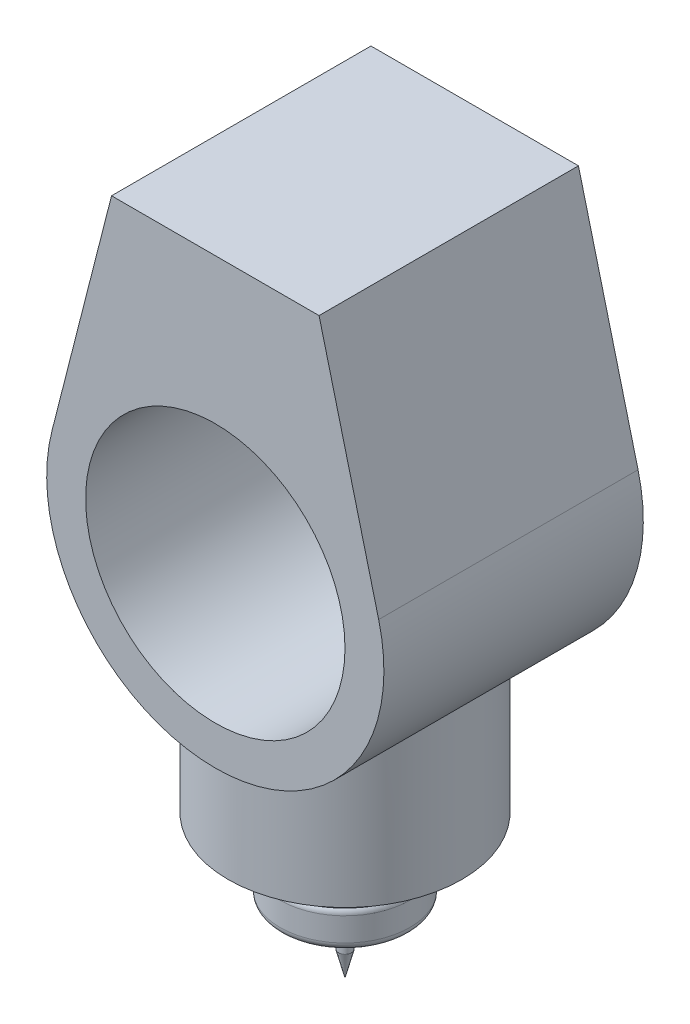
ISO-10303-21;
HEADER;
FILE_DESCRIPTION(('STEP AP214'),'2;1');
FILE_NAME('part.step','',(''),(''),'','','');
FILE_SCHEMA(('AUTOMOTIVE_DESIGN { 1 0 10303 214 1 1 1 1 }'));
ENDSEC;
DATA;
#1=APPLICATION_CONTEXT('core data for automotive mechanical design processes');
#2=APPLICATION_PROTOCOL_DEFINITION('international standard','automotive_design',2000,#1);
#3=PRODUCT_CONTEXT('',#1,'mechanical');
#4=PRODUCT('Part','Part','',(#3));
#5=PRODUCT_RELATED_PRODUCT_CATEGORY('part','',(#4));
#6=PRODUCT_DEFINITION_FORMATION('','',#4);
#7=PRODUCT_DEFINITION_CONTEXT('part definition',#1,'design');
#8=PRODUCT_DEFINITION('design','',#6,#7);
#9=PRODUCT_DEFINITION_SHAPE('','',#8);
#10=(LENGTH_UNIT() NAMED_UNIT(*) SI_UNIT(.MILLI.,.METRE.));
#11=(NAMED_UNIT(*) PLANE_ANGLE_UNIT() SI_UNIT($,.RADIAN.));
#12=(NAMED_UNIT(*) SI_UNIT($,.STERADIAN.) SOLID_ANGLE_UNIT());
#13=UNCERTAINTY_MEASURE_WITH_UNIT(LENGTH_MEASURE(1.E-05),#10,'distance_accuracy_value','');
#14=(GEOMETRIC_REPRESENTATION_CONTEXT(3) GLOBAL_UNCERTAINTY_ASSIGNED_CONTEXT((#13)) GLOBAL_UNIT_ASSIGNED_CONTEXT((#10,
#11,#12)) REPRESENTATION_CONTEXT('',''));
#15=CARTESIAN_POINT('',(0.,0.,0.));
#16=DIRECTION('',(0.,0.,1.));
#17=DIRECTION('',(1.,0.,0.));
#18=AXIS2_PLACEMENT_3D('',#15,#16,#17);
#19=CARTESIAN_POINT('',(0.,-45.7119917553549,0.));
#20=DIRECTION('',(0.,-1.,0.));
#21=DIRECTION('',(0.,0.,-1.));
#22=AXIS2_PLACEMENT_3D('',#19,#20,#21);
#23=CYLINDRICAL_SURFACE('',#22,20.);
#24=CARTESIAN_POINT('',(0.,5.26054272377328,0.));
#25=DIRECTION('',(0.,-1.,0.));
#26=DIRECTION('',(0.,0.,-1.));
#27=AXIS2_PLACEMENT_3D('',#24,#25,#26);
#28=CIRCLE('',#27,20.);
#29=CARTESIAN_POINT('',(0.,5.26054272377328,-20.));
#30=VERTEX_POINT('',#29);
#31=EDGE_CURVE('E205',#30,#30,#28,.T.);
#32=ORIENTED_EDGE('',*,*,#31,.T.);
#33=EDGE_LOOP('',(#32));
#34=FACE_BOUND('',#33,.T.);
#35=CARTESIAN_POINT('',(0.,4.26054272377328,0.));
#36=DIRECTION('',(0.,-1.,0.));
#37=DIRECTION('',(0.,0.,-1.));
#38=AXIS2_PLACEMENT_3D('',#35,#36,#37);
#39=CIRCLE('',#38,20.);
#40=CARTESIAN_POINT('',(0.,4.26054272377328,-20.));
#41=VERTEX_POINT('',#40);
#42=EDGE_CURVE('E199',#41,#41,#39,.F.);
#43=ORIENTED_EDGE('',*,*,#42,.T.);
#44=EDGE_LOOP('',(#43));
#45=FACE_BOUND('',#44,.T.);
#46=ADVANCED_FACE('F36',(#34,#45),#23,.T.);
#47=CARTESIAN_POINT('',(0.,-45.7119917553549,0.));
#48=DIRECTION('',(0.,-1.,0.));
#49=DIRECTION('',(0.,0.,-1.));
#50=AXIS2_PLACEMENT_3D('',#47,#48,#49);
#51=CYLINDRICAL_SURFACE('',#50,25.);
#52=CARTESIAN_POINT('',(0.,-10.7394572762267,0.));
#53=DIRECTION('',(0.,1.,0.));
#54=DIRECTION('',(0.,0.,1.));
#55=AXIS2_PLACEMENT_3D('',#52,#53,#54);
#56=CIRCLE('',#55,25.);
#57=CARTESIAN_POINT('',(0.,-10.7394572762267,25.));
#58=VERTEX_POINT('',#57);
#59=EDGE_CURVE('E193',#58,#58,#56,.T.);
#60=ORIENTED_EDGE('',*,*,#59,.T.);
#61=EDGE_LOOP('',(#60));
#62=FACE_BOUND('',#61,.T.);
#63=CARTESIAN_POINT('',(0.,-1.65553705932634,0.));
#64=DIRECTION('',(0.,1.,0.));
#65=DIRECTION('',(0.,0.,1.));
#66=AXIS2_PLACEMENT_3D('',#63,#64,#65);
#67=CIRCLE('',#66,25.);
#68=CARTESIAN_POINT('',(0.,-1.65553705932634,25.));
#69=VERTEX_POINT('',#68);
#70=EDGE_CURVE('E191',#69,#69,#67,.F.);
#71=ORIENTED_EDGE('',*,*,#70,.T.);
#72=EDGE_LOOP('',(#71));
#73=FACE_BOUND('',#72,.T.);
#74=ADVANCED_FACE('F153',(#62,#73),#51,.T.);
#75=CARTESIAN_POINT('',(-25.,-13.7394572762267,0.));
#76=DIRECTION('',(0.,1.,0.));
#77=DIRECTION('',(0.,0.,1.));
#78=AXIS2_PLACEMENT_3D('',#75,#76,#77);
#79=PLANE('',#78);
#80=CARTESIAN_POINT('',(0.,-13.7394572762267,0.));
#81=DIRECTION('',(0.,1.,0.));
#82=DIRECTION('',(0.,0.,1.));
#83=AXIS2_PLACEMENT_3D('',#80,#81,#82);
#84=CIRCLE('',#83,22.);
#85=CARTESIAN_POINT('',(0.,-13.7394572762267,22.));
#86=VERTEX_POINT('',#85);
#87=EDGE_CURVE('E194',#86,#86,#84,.F.);
#88=ORIENTED_EDGE('',*,*,#87,.T.);
#89=EDGE_LOOP('',(#88));
#90=FACE_BOUND('',#89,.T.);
#91=CARTESIAN_POINT('',(0.,-13.7394572762267,0.));
#92=DIRECTION('',(0.,-1.,0.));
#93=DIRECTION('',(0.,0.,-1.));
#94=AXIS2_PLACEMENT_3D('',#91,#92,#93);
#95=CIRCLE('',#94,10.);
#96=CARTESIAN_POINT('',(0.,-13.7394572762267,-10.));
#97=VERTEX_POINT('',#96);
#98=EDGE_CURVE('E365',#97,#97,#95,.T.);
#99=ORIENTED_EDGE('',*,*,#98,.F.);
#100=EDGE_LOOP('',(#99));
#101=FACE_BOUND('',#100,.T.);
#102=ADVANCED_FACE('F159',(#90,#101),#79,.F.);
#103=CARTESIAN_POINT('',(0.,-13.7394572762267,0.));
#104=DIRECTION('',(0.,1.,0.));
#105=DIRECTION('',(0.,0.,1.));
#106=AXIS2_PLACEMENT_3D('',#103,#104,#105);
#107=CONICAL_SURFACE('',#106,10.,0.523598775598297);
#108=CARTESIAN_POINT('',(0.,-22.3997113140711,0.));
#109=DIRECTION('',(0.,-1.,0.));
#110=DIRECTION('',(0.,0.,-1.));
#111=AXIS2_PLACEMENT_3D('',#108,#109,#110);
#112=CIRCLE('',#111,5.00000000000002);
#113=CARTESIAN_POINT('',(0.,-22.3997113140711,-5.00000000000002));
#114=VERTEX_POINT('',#113);
#115=EDGE_CURVE('E362',#114,#114,#112,.T.);
#116=ORIENTED_EDGE('',*,*,#115,.F.);
#117=EDGE_LOOP('',(#116));
#118=FACE_BOUND('',#117,.T.);
#119=ORIENTED_EDGE('',*,*,#98,.T.);
#120=EDGE_LOOP('',(#119));
#121=FACE_BOUND('',#120,.T.);
#122=ADVANCED_FACE('F301',(#118,#121),#107,.T.);
#123=CARTESIAN_POINT('',(-5.00000000000002,-22.3997113140711,0.));
#124=DIRECTION('',(0.,1.,0.));
#125=DIRECTION('',(0.,0.,1.));
#126=AXIS2_PLACEMENT_3D('',#123,#124,#125);
#127=PLANE('',#126);
#128=CARTESIAN_POINT('',(0.,-22.3997113140711,0.));
#129=DIRECTION('',(0.,-1.,0.));
#130=DIRECTION('',(0.,0.,-1.));
#131=AXIS2_PLACEMENT_3D('',#128,#129,#130);
#132=CIRCLE('',#131,2.50000000000002);
#133=CARTESIAN_POINT('',(0.,-22.3997113140711,-2.50000000000002));
#134=VERTEX_POINT('',#133);
#135=EDGE_CURVE('E369',#134,#134,#132,.T.);
#136=ORIENTED_EDGE('',*,*,#135,.F.);
#137=EDGE_LOOP('',(#136));
#138=FACE_BOUND('',#137,.T.);
#139=ORIENTED_EDGE('',*,*,#115,.T.);
#140=EDGE_LOOP('',(#139));
#141=FACE_BOUND('',#140,.T.);
#142=ADVANCED_FACE('F329',(#138,#141),#127,.F.);
#143=CARTESIAN_POINT('',(0.,-45.7119917553549,0.));
#144=DIRECTION('',(0.,-1.,0.));
#145=DIRECTION('',(0.,0.,-1.));
#146=AXIS2_PLACEMENT_3D('',#143,#144,#145);
#147=CYLINDRICAL_SURFACE('',#146,2.50000000000002);
#148=CARTESIAN_POINT('',(0.,-30.3997113140711,0.));
#149=DIRECTION('',(0.,-1.,0.));
#150=DIRECTION('',(0.,0.,-1.));
#151=AXIS2_PLACEMENT_3D('',#148,#149,#150);
#152=CIRCLE('',#151,2.50000000000002);
#153=CARTESIAN_POINT('',(0.,-30.3997113140711,-2.50000000000002));
#154=VERTEX_POINT('',#153);
#155=EDGE_CURVE('E124',#154,#154,#152,.T.);
#156=ORIENTED_EDGE('',*,*,#155,.F.);
#157=EDGE_LOOP('',(#156));
#158=FACE_BOUND('',#157,.T.);
#159=ORIENTED_EDGE('',*,*,#135,.T.);
#160=EDGE_LOOP('',(#159));
#161=FACE_BOUND('',#160,.T.);
#162=ADVANCED_FACE('F320',(#158,#161),#147,.T.);
#163=CARTESIAN_POINT('',(0.,-30.3997113140711,0.));
#164=DIRECTION('',(0.,1.,0.));
#165=DIRECTION('',(0.,0.,1.));
#166=AXIS2_PLACEMENT_3D('',#163,#164,#165);
#167=CONICAL_SURFACE('',#166,2.50000000000002,0.25268025514208);
#168=CARTESIAN_POINT('',(0.,-40.0821696795896,0.));
#169=VERTEX_POINT('',#168);
#170=VERTEX_LOOP('',#169);
#171=FACE_BOUND('',#170,.T.);
#172=ORIENTED_EDGE('',*,*,#155,.T.);
#173=EDGE_LOOP('',(#172));
#174=FACE_BOUND('',#173,.T.);
#175=ADVANCED_FACE('F170',(#171,#174),#167,.T.);
#176=CARTESIAN_POINT('',(0.,4.26054272377328,0.));
#177=DIRECTION('',(0.,-1.,0.));
#178=DIRECTION('',(0.,0.,-1.));
#179=AXIS2_PLACEMENT_3D('',#176,#177,#178);
#180=TOROIDAL_SURFACE('',#179,23.,3.);
#181=CARTESIAN_POINT('',(0.,1.30250283222513,0.));
#182=DIRECTION('',(0.,1.,0.));
#183=DIRECTION('',(0.,0.,1.));
#184=AXIS2_PLACEMENT_3D('',#181,#182,#183);
#185=CIRCLE('',#184,22.5000000000003);
#186=CARTESIAN_POINT('',(0.,1.30250283222513,22.5000000000003));
#187=VERTEX_POINT('',#186);
#188=EDGE_CURVE('E188',#187,#187,#185,.T.);
#189=ORIENTED_EDGE('',*,*,#188,.T.);
#190=EDGE_LOOP('',(#189));
#191=FACE_BOUND('',#190,.T.);
#192=ORIENTED_EDGE('',*,*,#42,.F.);
#193=EDGE_LOOP('',(#192));
#194=FACE_BOUND('',#193,.T.);
#195=ADVANCED_FACE('F166',(#191,#194),#180,.F.);
#196=CARTESIAN_POINT('',(0.,-10.7394572762267,0.));
#197=DIRECTION('',(0.,1.,0.));
#198=DIRECTION('',(0.,0.,1.));
#199=AXIS2_PLACEMENT_3D('',#196,#197,#198);
#200=TOROIDAL_SURFACE('',#199,22.,3.);
#201=ORIENTED_EDGE('',*,*,#59,.F.);
#202=EDGE_LOOP('',(#201));
#203=FACE_BOUND('',#202,.T.);
#204=ORIENTED_EDGE('',*,*,#87,.F.);
#205=EDGE_LOOP('',(#204));
#206=FACE_BOUND('',#205,.T.);
#207=ADVANCED_FACE('F169',(#203,#206),#200,.T.);
#208=CARTESIAN_POINT('',(0.,-1.65553705932634,0.));
#209=DIRECTION('',(0.,1.,0.));
#210=DIRECTION('',(0.,0.,1.));
#211=AXIS2_PLACEMENT_3D('',#208,#209,#210);
#212=TOROIDAL_SURFACE('',#211,22.,3.);
#213=ORIENTED_EDGE('',*,*,#188,.F.);
#214=EDGE_LOOP('',(#213));
#215=FACE_BOUND('',#214,.T.);
#216=ORIENTED_EDGE('',*,*,#70,.F.);
#217=EDGE_LOOP('',(#216));
#218=FACE_BOUND('',#217,.T.);
#219=ADVANCED_FACE('F174',(#215,#218),#212,.T.);
#220=CARTESIAN_POINT('',(0.,5.26054272377328,0.));
#221=DIRECTION('',(0.,1.,0.));
#222=DIRECTION('',(0.,0.,1.));
#223=AXIS2_PLACEMENT_3D('',#220,#221,#222);
#224=CYLINDRICAL_SURFACE('',#223,32.5);
#225=CARTESIAN_POINT('',(0.,7.26054272377328,0.));
#226=DIRECTION('',(0.,-1.,0.));
#227=DIRECTION('',(0.,0.,-1.));
#228=AXIS2_PLACEMENT_3D('',#225,#226,#227);
#229=CIRCLE('',#228,32.5);
#230=CARTESIAN_POINT('',(0.,7.26054272377328,-32.5));
#231=VERTEX_POINT('',#230);
#232=EDGE_CURVE('E11',#231,#231,#229,.F.);
#233=ORIENTED_EDGE('',*,*,#232,.T.);
#234=EDGE_LOOP('',(#233));
#235=FACE_BOUND('',#234,.T.);
#236=CARTESIAN_POINT('',(0.,13.2605427237733,0.));
#237=DIRECTION('',(0.,1.,0.));
#238=DIRECTION('',(0.,0.,1.));
#239=AXIS2_PLACEMENT_3D('',#236,#237,#238);
#240=CIRCLE('',#239,32.5);
#241=CARTESIAN_POINT('',(0.,13.2605427237733,32.5));
#242=VERTEX_POINT('',#241);
#243=EDGE_CURVE('E204',#242,#242,#240,.F.);
#244=ORIENTED_EDGE('',*,*,#243,.T.);
#245=EDGE_LOOP('',(#244));
#246=FACE_BOUND('',#245,.T.);
#247=ADVANCED_FACE('F177',(#235,#246),#224,.T.);
#248=CARTESIAN_POINT('',(0.,5.26054272377328,0.));
#249=DIRECTION('',(0.,-1.,0.));
#250=DIRECTION('',(0.,0.,-1.));
#251=AXIS2_PLACEMENT_3D('',#248,#249,#250);
#252=PLANE('',#251);
#253=CARTESIAN_POINT('',(0.,5.26054272377328,0.));
#254=DIRECTION('',(0.,-1.,0.));
#255=DIRECTION('',(0.,0.,-1.));
#256=AXIS2_PLACEMENT_3D('',#253,#254,#255);
#257=CIRCLE('',#256,30.5);
#258=CARTESIAN_POINT('',(0.,5.26054272377328,-30.5));
#259=VERTEX_POINT('',#258);
#260=EDGE_CURVE('E44',#259,#259,#257,.T.);
#261=ORIENTED_EDGE('',*,*,#260,.T.);
#262=EDGE_LOOP('',(#261));
#263=FACE_BOUND('',#262,.T.);
#264=ORIENTED_EDGE('',*,*,#31,.F.);
#265=EDGE_LOOP('',(#264));
#266=FACE_BOUND('',#265,.T.);
#267=ADVANCED_FACE('F182',(#263,#266),#252,.T.);
#268=CARTESIAN_POINT('',(0.,120.,50.));
#269=DIRECTION('',(0.,0.,-1.));
#270=DIRECTION('',(-1.,0.,0.));
#271=AXIS2_PLACEMENT_3D('',#268,#269,#270);
#272=CYLINDRICAL_SURFACE('',#271,50.);
#273=CARTESIAN_POINT('',(0.,120.,50.));
#274=DIRECTION('',(0.,0.,1.));
#275=DIRECTION('',(1.,0.,0.));
#276=AXIS2_PLACEMENT_3D('',#273,#274,#275);
#277=CIRCLE('',#276,50.);
#278=CARTESIAN_POINT('',(50.,120.,50.));
#279=VERTEX_POINT('',#278);
#280=EDGE_CURVE('E112',#279,#279,#277,.T.);
#281=ORIENTED_EDGE('',*,*,#280,.T.);
#282=EDGE_LOOP('',(#281));
#283=FACE_BOUND('',#282,.T.);
#284=CARTESIAN_POINT('',(0.,120.,-50.));
#285=DIRECTION('',(0.,0.,1.));
#286=DIRECTION('',(1.,0.,0.));
#287=AXIS2_PLACEMENT_3D('',#284,#285,#286);
#288=CIRCLE('',#287,50.);
#289=CARTESIAN_POINT('',(50.,120.,-50.));
#290=VERTEX_POINT('',#289);
#291=EDGE_CURVE('E207',#290,#290,#288,.T.);
#292=ORIENTED_EDGE('',*,*,#291,.F.);
#293=EDGE_LOOP('',(#292));
#294=FACE_BOUND('',#293,.T.);
#295=ADVANCED_FACE('F242',(#283,#294),#272,.F.);
#296=CARTESIAN_POINT('',(40.,226.080432898653,50.));
#297=DIRECTION('',(0.,-1.,0.));
#298=DIRECTION('',(0.,0.,-1.));
#299=AXIS2_PLACEMENT_3D('',#296,#297,#298);
#300=PLANE('',#299);
#301=DIRECTION('',(-1.,0.,0.));
#302=VECTOR('',#301,1.);
#303=CARTESIAN_POINT('',(40.,226.080432898653,-50.));
#304=LINE('',#303,#302);
#305=CARTESIAN_POINT('',(40.,226.080432898653,-50.));
#306=VERTEX_POINT('',#305);
#307=CARTESIAN_POINT('',(-40.,226.080432898653,-50.));
#308=VERTEX_POINT('',#307);
#309=EDGE_CURVE('E75',#306,#308,#304,.T.);
#310=ORIENTED_EDGE('',*,*,#309,.T.);
#311=DIRECTION('',(0.,0.,-1.));
#312=VECTOR('',#311,1.);
#313=CARTESIAN_POINT('',(-40.,226.080432898653,50.));
#314=LINE('',#313,#312);
#315=CARTESIAN_POINT('',(-40.,226.080432898653,50.));
#316=VERTEX_POINT('',#315);
#317=EDGE_CURVE('E105',#316,#308,#314,.T.);
#318=ORIENTED_EDGE('',*,*,#317,.F.);
#319=DIRECTION('',(-1.,0.,0.));
#320=VECTOR('',#319,1.);
#321=CARTESIAN_POINT('',(40.,226.080432898653,50.));
#322=LINE('',#321,#320);
#323=CARTESIAN_POINT('',(40.,226.080432898653,50.));
#324=VERTEX_POINT('',#323);
#325=EDGE_CURVE('E55',#324,#316,#322,.T.);
#326=ORIENTED_EDGE('',*,*,#325,.F.);
#327=DIRECTION('',(0.,0.,-1.));
#328=VECTOR('',#327,1.);
#329=CARTESIAN_POINT('',(40.,226.080432898653,50.));
#330=LINE('',#329,#328);
#331=EDGE_CURVE('E101',#324,#306,#330,.T.);
#332=ORIENTED_EDGE('',*,*,#331,.T.);
#333=EDGE_LOOP('',(#310,#318,#326,#332));
#334=FACE_BOUND('',#333,.T.);
#335=ADVANCED_FACE('F246',(#334),#300,.F.);
#336=CARTESIAN_POINT('',(-40.,226.080432898653,50.));
#337=DIRECTION('',(0.968915660351213,-0.247391275363892,0.));
#338=DIRECTION('',(0.247391275363892,0.968915660351213,0.));
#339=AXIS2_PLACEMENT_3D('',#336,#337,#338);
#340=PLANE('',#339);
#341=DIRECTION('',(-0.247391275363892,-0.968915660351213,0.));
#342=VECTOR('',#341,1.);
#343=CARTESIAN_POINT('',(-40.,226.080432898653,-50.));
#344=LINE('',#343,#342);
#345=CARTESIAN_POINT('',(-62.9795179228289,136.080432898653,-50.));
#346=VERTEX_POINT('',#345);
#347=EDGE_CURVE('E109',#308,#346,#344,.T.);
#348=ORIENTED_EDGE('',*,*,#347,.T.);
#349=DIRECTION('',(0.,0.,-1.));
#350=VECTOR('',#349,1.);
#351=CARTESIAN_POINT('',(-62.9795179228289,136.080432898653,50.));
#352=LINE('',#351,#350);
#353=CARTESIAN_POINT('',(-62.9795179228289,136.080432898653,50.));
#354=VERTEX_POINT('',#353);
#355=EDGE_CURVE('E100',#354,#346,#352,.T.);
#356=ORIENTED_EDGE('',*,*,#355,.F.);
#357=DIRECTION('',(-0.247391275363892,-0.968915660351213,0.));
#358=VECTOR('',#357,1.);
#359=CARTESIAN_POINT('',(-40.,226.080432898653,50.));
#360=LINE('',#359,#358);
#361=EDGE_CURVE('E90',#316,#354,#360,.T.);
#362=ORIENTED_EDGE('',*,*,#361,.F.);
#363=ORIENTED_EDGE('',*,*,#317,.T.);
#364=EDGE_LOOP('',(#348,#356,#362,#363));
#365=FACE_BOUND('',#364,.T.);
#366=ADVANCED_FACE('F138',(#365),#340,.F.);
#367=CARTESIAN_POINT('',(0.,120.,50.));
#368=DIRECTION('',(0.,0.,1.));
#369=DIRECTION('',(1.,0.,0.));
#370=AXIS2_PLACEMENT_3D('',#367,#368,#369);
#371=PLANE('',#370);
#372=ORIENTED_EDGE('',*,*,#361,.T.);
#373=CARTESIAN_POINT('',(0.,120.,50.));
#374=DIRECTION('',(0.,0.,1.));
#375=DIRECTION('',(1.,0.,0.));
#376=AXIS2_PLACEMENT_3D('',#373,#374,#375);
#377=CIRCLE('',#376,65.);
#378=CARTESIAN_POINT('',(62.9795179228289,136.080432898653,50.));
#379=VERTEX_POINT('',#378);
#380=EDGE_CURVE('E83',#354,#379,#377,.T.);
#381=ORIENTED_EDGE('',*,*,#380,.T.);
#382=DIRECTION('',(-0.247391275363892,0.968915660351213,0.));
#383=VECTOR('',#382,1.);
#384=CARTESIAN_POINT('',(40.,226.080432898653,50.));
#385=LINE('',#384,#383);
#386=EDGE_CURVE('E87',#379,#324,#385,.T.);
#387=ORIENTED_EDGE('',*,*,#386,.T.);
#388=ORIENTED_EDGE('',*,*,#325,.T.);
#389=EDGE_LOOP('',(#372,#381,#387,#388));
#390=FACE_BOUND('',#389,.T.);
#391=ORIENTED_EDGE('',*,*,#280,.F.);
#392=EDGE_LOOP('',(#391));
#393=FACE_BOUND('',#392,.T.);
#394=ADVANCED_FACE('F84',(#390,#393),#371,.T.);
#395=CARTESIAN_POINT('',(40.,226.080432898653,50.));
#396=DIRECTION('',(-0.968915660351213,-0.247391275363892,0.));
#397=DIRECTION('',(0.247391275363892,-0.968915660351213,0.));
#398=AXIS2_PLACEMENT_3D('',#395,#396,#397);
#399=PLANE('',#398);
#400=DIRECTION('',(-0.247391275363892,0.968915660351213,0.));
#401=VECTOR('',#400,1.);
#402=CARTESIAN_POINT('',(40.,226.080432898653,-50.));
#403=LINE('',#402,#401);
#404=CARTESIAN_POINT('',(62.9795179228289,136.080432898653,-50.));
#405=VERTEX_POINT('',#404);
#406=EDGE_CURVE('E114',#405,#306,#403,.T.);
#407=ORIENTED_EDGE('',*,*,#406,.T.);
#408=ORIENTED_EDGE('',*,*,#331,.F.);
#409=ORIENTED_EDGE('',*,*,#386,.F.);
#410=DIRECTION('',(0.,0.,-1.));
#411=VECTOR('',#410,1.);
#412=CARTESIAN_POINT('',(62.9795179228289,136.080432898653,50.));
#413=LINE('',#412,#411);
#414=EDGE_CURVE('E94',#379,#405,#413,.T.);
#415=ORIENTED_EDGE('',*,*,#414,.T.);
#416=EDGE_LOOP('',(#407,#408,#409,#415));
#417=FACE_BOUND('',#416,.T.);
#418=ADVANCED_FACE('F103',(#417),#399,.F.);
#419=CARTESIAN_POINT('',(0.,120.,-50.));
#420=DIRECTION('',(0.,0.,1.));
#421=DIRECTION('',(1.,0.,0.));
#422=AXIS2_PLACEMENT_3D('',#419,#420,#421);
#423=PLANE('',#422);
#424=ORIENTED_EDGE('',*,*,#347,.F.);
#425=ORIENTED_EDGE('',*,*,#309,.F.);
#426=ORIENTED_EDGE('',*,*,#406,.F.);
#427=CARTESIAN_POINT('',(0.,120.,-50.));
#428=DIRECTION('',(0.,0.,1.));
#429=DIRECTION('',(1.,0.,0.));
#430=AXIS2_PLACEMENT_3D('',#427,#428,#429);
#431=CIRCLE('',#430,65.);
#432=EDGE_CURVE('E97',#346,#405,#431,.T.);
#433=ORIENTED_EDGE('',*,*,#432,.F.);
#434=EDGE_LOOP('',(#424,#425,#426,#433));
#435=FACE_BOUND('',#434,.T.);
#436=ORIENTED_EDGE('',*,*,#291,.T.);
#437=EDGE_LOOP('',(#436));
#438=FACE_BOUND('',#437,.T.);
#439=ADVANCED_FACE('F250',(#435,#438),#423,.F.);
#440=CARTESIAN_POINT('',(0.,120.,50.));
#441=DIRECTION('',(0.,0.,-1.));
#442=DIRECTION('',(-1.,0.,0.));
#443=AXIS2_PLACEMENT_3D('',#440,#441,#442);
#444=CYLINDRICAL_SURFACE('',#443,65.);
#445=ORIENTED_EDGE('',*,*,#432,.T.);
#446=ORIENTED_EDGE('',*,*,#414,.F.);
#447=ORIENTED_EDGE('',*,*,#380,.F.);
#448=ORIENTED_EDGE('',*,*,#355,.T.);
#449=EDGE_LOOP('',(#445,#446,#447,#448));
#450=FACE_BOUND('',#449,.T.);
#451=CARTESIAN_POINT('',(0.,55.0000000000045,-45.));
#452=CARTESIAN_POINT('',(-1.12147330120578,54.9999988303988,-45.0000012025283));
#453=CARTESIAN_POINT('',(-2.24292945230804,55.02908402348,-44.9580201602482));
#454=CARTESIAN_POINT('',(-4.4765841407912,55.1446931358605,-44.7907856093689));
#455=CARTESIAN_POINT('',(-5.58878288911968,55.2312157426909,-44.6655340035371));
#456=CARTESIAN_POINT('',(-7.79555151848658,55.4596214237002,-44.3336771879691));
#457=CARTESIAN_POINT('',(-8.89011506447775,55.6015239496546,-44.1270433931238));
#458=CARTESIAN_POINT('',(-11.0533096019769,55.9373542563034,-43.6354760134034));
#459=CARTESIAN_POINT('',(-12.1219400915897,56.1312830430136,-43.3505409144375));
#460=CARTESIAN_POINT('',(-14.2212125160507,56.5657777255338,-42.7078017297045));
#461=CARTESIAN_POINT('',(-15.2520162370064,56.8061081454356,-42.3503651251477));
#462=CARTESIAN_POINT('',(-17.2756280115287,57.3290740553076,-41.5659763086892));
#463=CARTESIAN_POINT('',(-18.268436318107,57.6117092635086,-41.1390245597888));
#464=CARTESIAN_POINT('',(-20.2116697228796,58.213891446068,-40.2199419970837));
#465=CARTESIAN_POINT('',(-21.1620951960856,58.5334380937369,-39.7278117601443));
#466=CARTESIAN_POINT('',(-23.0172309124316,59.2037828415936,-38.6825647509799));
#467=CARTESIAN_POINT('',(-23.9219389167187,59.5545824699667,-38.1294449962194));
#468=CARTESIAN_POINT('',(-25.760188014023,60.3134351025527,-36.9151737617933));
#469=CARTESIAN_POINT('',(-26.6893215363406,60.7238118459801,-36.2488040005489));
#470=CARTESIAN_POINT('',(-28.4880338622969,61.5669724942752,-34.8529502059223));
#471=CARTESIAN_POINT('',(-29.3576098626541,61.999757452182,-34.1234632053606));
#472=CARTESIAN_POINT('',(-31.0364486388515,62.8804888163524,-32.6040251352401));
#473=CARTESIAN_POINT('',(-31.8456267033453,63.328455281811,-31.8139921794121));
#474=CARTESIAN_POINT('',(-33.4006700551816,64.2308013938863,-30.1773036556991));
#475=CARTESIAN_POINT('',(-34.1465316534291,64.6851814123882,-29.3306447936719));
#476=CARTESIAN_POINT('',(-35.6959084068905,65.6696885654406,-27.4326466159465));
#477=CARTESIAN_POINT('',(-36.4872853280243,66.1994062488732,-26.3711450656524));
#478=CARTESIAN_POINT('',(-37.9773509509912,67.2406672108068,-24.1760402563897));
#479=CARTESIAN_POINT('',(-38.6760162868263,67.7522058839774,-23.0424189272515));
#480=CARTESIAN_POINT('',(-39.9749077721745,68.7391850734958,-20.7072341856926));
#481=CARTESIAN_POINT('',(-40.5752630453965,69.2146724924728,-19.5057627267964));
#482=CARTESIAN_POINT('',(-41.6721166930026,70.1107600836208,-17.0369318640638));
#483=CARTESIAN_POINT('',(-42.1686687478854,70.5313885828343,-15.769606940994));
#484=CARTESIAN_POINT('',(-42.9149535309565,71.1791970583122,-13.5723996352813));
#485=CARTESIAN_POINT('',(-43.1936925213246,71.4261579736443,-12.6581208440973));
#486=CARTESIAN_POINT('',(-43.6944569649789,71.8761198255877,-10.8035389223548));
#487=CARTESIAN_POINT('',(-43.9164916250902,72.0791278978071,-9.86324004407391));
#488=CARTESIAN_POINT('',(-44.3005296261305,72.4339245073453,-7.96250438663381));
#489=CARTESIAN_POINT('',(-44.4626304606428,72.5857961912956,-7.00210302149459));
#490=CARTESIAN_POINT('',(-44.7246555122386,72.8328736154823,-5.0655405262849));
#491=CARTESIAN_POINT('',(-44.824579749433,72.9280793740471,-4.08937940131198));
#492=CARTESIAN_POINT('',(-44.9607388198673,73.0581100909057,-2.12323648479645));
#493=CARTESIAN_POINT('',(-44.9966266570423,73.0926060654583,-1.13320851844634));
#494=CARTESIAN_POINT('',(-45.0029190462422,73.0986428864524,0.847248377094085));
#495=CARTESIAN_POINT('',(-44.9733237202183,73.0701838501369,1.83767730553423));
#496=CARTESIAN_POINT('',(-44.8492190899201,72.9515697150179,3.81128752429104));
#497=CARTESIAN_POINT('',(-44.754670149242,72.8613769447899,4.79446401850684));
#498=CARTESIAN_POINT('',(-44.5024241630868,72.623168682392,6.74551496467478));
#499=CARTESIAN_POINT('',(-44.3447257499009,72.4751519378562,7.71338908473189));
#500=CARTESIAN_POINT('',(-43.9803320764262,72.1378235728159,9.56919366964704));
#501=CARTESIAN_POINT('',(-43.7772163066585,71.9515850911135,10.4583970625521));
#502=CARTESIAN_POINT('',(-43.3201064011899,71.5390558953593,12.2144143492183));
#503=CARTESIAN_POINT('',(-43.0660934784814,71.3127503954885,13.0812198417585));
#504=CARTESIAN_POINT('',(-42.5096331932464,70.8261490359616,14.7898225666929));
#505=CARTESIAN_POINT('',(-42.2071601049958,70.5658351361165,15.6316062329483));
#506=CARTESIAN_POINT('',(-41.5563350032134,70.0174817203665,17.2876417419015));
#507=CARTESIAN_POINT('',(-41.2079902580443,69.7294465988303,18.1018979206951));
#508=CARTESIAN_POINT('',(-40.2767822129267,68.9774568528655,20.1137766396804));
#509=CARTESIAN_POINT('',(-39.6654891440571,68.4992565476671,21.2930273345179));
#510=CARTESIAN_POINT('',(-38.3480299208519,67.5108841218522,23.5833678403923));
#511=CARTESIAN_POINT('',(-37.6418264436725,67.0006994659411,24.6944305853526));
#512=CARTESIAN_POINT('',(-36.1376496350165,65.9638442026505,26.8476775780097));
#513=CARTESIAN_POINT('',(-35.3395185623558,65.4371464214538,27.8897384505713));
#514=CARTESIAN_POINT('',(-33.6558443419669,64.3828195532821,29.8998791095634));
#515=CARTESIAN_POINT('',(-32.7703120184232,63.8551905895581,30.86796803075));
#516=CARTESIAN_POINT('',(-30.9045304086317,62.8067550298864,32.736392147566));
#517=CARTESIAN_POINT('',(-29.923373129519,62.2860808649017,33.6358963165069));
#518=CARTESIAN_POINT('',(-27.8771206485977,61.2703580463534,35.3503553497922));
#519=CARTESIAN_POINT('',(-26.8120178135977,60.7753117299338,36.165302509702));
#520=CARTESIAN_POINT('',(-24.6035209522418,59.824343304436,37.7024332048815));
#521=CARTESIAN_POINT('',(-23.4602711709791,59.3683524348404,38.4247809320634));
#522=CARTESIAN_POINT('',(-21.0989507187332,58.5068108391788,39.770332376577));
#523=CARTESIAN_POINT('',(-19.8809026570886,58.1012449821269,40.3935658507716));
#524=CARTESIAN_POINT('',(-17.654903587576,57.4353197052216,41.4059204565396));
#525=CARTESIAN_POINT('',(-16.6602403417731,57.1627017451532,41.816312053501));
#526=CARTESIAN_POINT('',(-14.6345031625141,56.6602835922671,42.5675669112336));
#527=CARTESIAN_POINT('',(-13.6034342999587,56.4304774640019,42.9084398107235));
#528=CARTESIAN_POINT('',(-11.5110112910013,56.0184950097403,43.5164676119119));
#529=CARTESIAN_POINT('',(-10.4496726714619,55.8362947349256,43.7836595836379));
#530=CARTESIAN_POINT('',(-8.30296993183346,55.5233601342049,44.2409869387356));
#531=CARTESIAN_POINT('',(-7.21760530180228,55.3926269017743,44.431120684921));
#532=CARTESIAN_POINT('',(-5.02649787174997,55.1852654263317,44.7321113931983));
#533=CARTESIAN_POINT('',(-3.92069290489737,55.1088465038306,44.8426616714378));
#534=CARTESIAN_POINT('',(-1.70145350776182,55.0127816642315,44.981563734156));
#535=CARTESIAN_POINT('',(-0.588019080747438,54.9931357228126,45.0099155538474));
#536=CARTESIAN_POINT('',(1.6374178193159,55.0110998758055,44.9839662509349));
#537=CARTESIAN_POINT('',(2.7494202874799,55.0487101650249,44.929664847113));
#538=CARTESIAN_POINT('',(4.96298947367625,55.1802655819471,44.7392747901951));
#539=CARTESIAN_POINT('',(6.06455651648149,55.2742089505535,44.6031886909653));
#540=CARTESIAN_POINT('',(8.18254449212171,55.508824296691,44.2620157992033));
#541=CARTESIAN_POINT('',(9.20007959997796,55.6463191319822,44.0616107864453));
#542=CARTESIAN_POINT('',(11.2121337136591,55.9662143939093,43.5930613516679));
#543=CARTESIAN_POINT('',(12.2066538475802,56.1486126144501,43.3249202574928));
#544=CARTESIAN_POINT('',(14.1673074608525,56.5548274750926,42.7239854011604));
#545=CARTESIAN_POINT('',(15.1334386601225,56.7786474315369,42.3911864622047));
#546=CARTESIAN_POINT('',(17.0327019487275,57.263663647323,41.6643868113868));
#547=CARTESIAN_POINT('',(17.9658321902032,57.5248619955152,41.2703826790342));
#548=CARTESIAN_POINT('',(19.8637431772397,58.1009914914879,40.3931275129007));
#549=CARTESIAN_POINT('',(20.8256806929255,58.41847904715,39.9054081529013));
#550=CARTESIAN_POINT('',(22.7035764997347,59.0857913608606,38.867707618121));
#551=CARTESIAN_POINT('',(23.619532978653,59.4356173918918,38.3177239921567));
#552=CARTESIAN_POINT('',(25.4032558353405,60.16186528706,37.1592008079417));
#553=CARTESIAN_POINT('',(26.2709963143292,60.538301202456,36.5506302507531));
#554=CARTESIAN_POINT('',(27.9557544991498,61.3115422329665,35.2787474176623));
#555=CARTESIAN_POINT('',(28.772769468114,61.708348445043,34.6154321925308));
#556=CARTESIAN_POINT('',(30.4889708749913,62.5848288146208,33.119920084716));
#557=CARTESIAN_POINT('',(31.378521200693,63.0671245447454,32.2781812569546));
#558=CARTESIAN_POINT('',(33.0839042215171,64.0409106890907,30.5278352445588));
#559=CARTESIAN_POINT('',(33.8997259516809,64.5324024578752,29.6192181500898));
#560=CARTESIAN_POINT('',(35.4558699474101,65.5139649612604,27.737571493399));
#561=CARTESIAN_POINT('',(36.1961418986445,66.0040345403884,26.7644997080005));
#562=CARTESIAN_POINT('',(37.5978502361013,66.9705165002566,24.7568233036379));
#563=CARTESIAN_POINT('',(38.2592969946586,67.4469306715851,23.7222268074146));
#564=CARTESIAN_POINT('',(39.429101356464,68.3200586522741,21.7149007388744));
#565=CARTESIAN_POINT('',(39.9463152685164,68.7196627515185,20.7485884228092));
#566=CARTESIAN_POINT('',(40.9130636661731,69.4876025451089,18.7705314851883));
#567=CARTESIAN_POINT('',(41.3625976757849,69.8559380195348,17.7587865441702));
#568=CARTESIAN_POINT('',(42.189330129269,70.5495071077636,15.6937972650627));
#569=CARTESIAN_POINT('',(42.5666442029471,70.8748093587528,14.6406225749499));
#570=CARTESIAN_POINT('',(43.2451098617227,71.4709901978989,12.4950157035287));
#571=CARTESIAN_POINT('',(43.5462799449171,71.7418820010048,11.4025931307275));
#572=CARTESIAN_POINT('',(44.0186874861181,72.1728389587625,9.39216299943492));
#573=CARTESIAN_POINT('',(44.2036946073208,72.3441580094782,8.47979353570401));
#574=CARTESIAN_POINT('',(44.517583244497,72.6372393046969,6.63757582668227));
#575=CARTESIAN_POINT('',(44.6464717105955,72.7590076857776,5.70772976070355));
#576=CARTESIAN_POINT('',(44.8459556683364,72.94833384295,3.83718735816953));
#577=CARTESIAN_POINT('',(44.9166073394188,73.0159438623491,2.89650236820496));
#578=CARTESIAN_POINT('',(44.9985645522097,73.0944301734318,1.01014116515017));
#579=CARTESIAN_POINT('',(45.0098692606967,73.105305668572,0.0644648821696078));
#580=CARTESIAN_POINT('',(44.972908524549,73.0698591222881,-1.82506201386822));
#581=CARTESIAN_POINT('',(44.9246160680299,73.0235111448304,-2.76891160474219));
#582=CARTESIAN_POINT('',(44.7693052695385,72.8754767696967,-4.6473189128988));
#583=CARTESIAN_POINT('',(44.6622872796082,72.773790703756,-5.58187668584892));
#584=CARTESIAN_POINT('',(44.3911660407895,72.5188576737371,-7.43666598606578));
#585=CARTESIAN_POINT('',(44.2269923369624,72.365547080606,-8.35687836049694));
#586=CARTESIAN_POINT('',(43.8440109221367,72.0128110964402,-10.1768310643424));
#587=CARTESIAN_POINT('',(43.6251959006592,71.8133795351311,-11.0765686368374));
#588=CARTESIAN_POINT('',(43.0625185245671,71.3091217077634,-13.1167261780631));
#589=CARTESIAN_POINT('',(42.7008255731353,70.99060276494,-14.2488681052184));
#590=CARTESIAN_POINT('',(41.8955268796885,70.300445505839,-16.4668795226375));
#591=CARTESIAN_POINT('',(41.4518955887102,69.9287906295837,-17.5527344499463));
#592=CARTESIAN_POINT('',(40.4872212981012,69.1455876280237,-19.676032998432));
#593=CARTESIAN_POINT('',(39.9660881554128,68.7339932450966,-20.7134183727639));
#594=CARTESIAN_POINT('',(38.8508952329154,67.8837881206939,-22.7363587217867));
#595=CARTESIAN_POINT('',(38.256840025456,67.4451790739464,-23.7219169406074));
#596=CARTESIAN_POINT('',(36.9847423381262,66.5420642214497,-25.6613286822635));
#597=CARTESIAN_POINT('',(36.305111863905,66.0771978898628,-26.6139712103079));
#598=CARTESIAN_POINT('',(34.8753950985047,65.1416666656053,-28.4617532840732));
#599=CARTESIAN_POINT('',(34.1253089107935,64.6710017814511,-29.3568929142369));
#600=CARTESIAN_POINT('',(32.5564691651911,63.7335660866497,-31.0876310121467));
#601=CARTESIAN_POINT('',(31.7376950080827,63.2667964906569,-31.9232114784022));
#602=CARTESIAN_POINT('',(30.0334816520248,62.3464834144564,-33.5315189390537));
#603=CARTESIAN_POINT('',(29.1480362003109,61.8929411803237,-34.3042400240123));
#604=CARTESIAN_POINT('',(27.1643113596243,60.9364715663755,-35.9022819462668));
#605=CARTESIAN_POINT('',(26.0547472869607,60.437389370908,-36.7159606163358));
#606=CARTESIAN_POINT('',(23.7521280348394,59.4823242770641,-38.2458641369293));
#607=CARTESIAN_POINT('',(22.5590599397194,59.0263480716925,-38.9620738611552));
#608=CARTESIAN_POINT('',(20.7127348127307,58.3850073420585,-39.95586233221));
#609=CARTESIAN_POINT('',(20.0881105839986,58.178408034482,-40.27358881652));
#610=CARTESIAN_POINT('',(18.8206694867553,57.7808452994142,-40.881243654886));
#611=CARTESIAN_POINT('',(18.1778552539994,57.5898796220434,-41.1711760099036));
#612=CARTESIAN_POINT('',(16.8752831176647,57.2251472766316,-41.7219931318357));
#613=CARTESIAN_POINT('',(16.2155288469418,57.0513769591447,-41.9828840638125));
#614=CARTESIAN_POINT('',(14.8804011558231,56.7224643524263,-42.4744610119284));
#615=CARTESIAN_POINT('',(14.2050288695915,56.567320715579,-42.7051492133046));
#616=CARTESIAN_POINT('',(12.4447010544913,56.1929278031899,-43.2597449448101));
#617=CARTESIAN_POINT('',(11.3490405228653,55.9885815531985,-43.5602757498286));
#618=CARTESIAN_POINT('',(9.12991345978803,55.6345808017913,-44.0788276443961));
#619=CARTESIAN_POINT('',(8.00645117856267,55.4849179950578,-44.2968612637911));
#620=CARTESIAN_POINT('',(5.74082253729136,55.2440006812936,-44.6470112993715));
#621=CARTESIAN_POINT('',(4.598670910622,55.1527022428948,-44.7791923387442));
#622=CARTESIAN_POINT('',(2.30434018473217,55.0307023703131,-44.9556862638234));
#623=CARTESIAN_POINT('',(1.152161041602,55.0000012016151,-44.999998764566));
#624=CARTESIAN_POINT('',(0.,55.0000000000045,-45.));
#625=B_SPLINE_CURVE_WITH_KNOTS('',3,(#451,#452,#453,#454,#455,#456,#457,#458,#459,#460,#461,
#462,#463,#464,#465,#466,#467,#468,#469,#470,#471,#472,#473,#474,#475,#476,#477,#478,#479,#480,
#481,#482,#483,#484,#485,#486,#487,#488,#489,#490,#491,#492,#493,#494,#495,#496,#497,#498,#499,
#500,#501,#502,#503,#504,#505,#506,#507,#508,#509,#510,#511,#512,#513,#514,#515,#516,#517,#518,
#519,#520,#521,#522,#523,#524,#525,#526,#527,#528,#529,#530,#531,#532,#533,#534,#535,#536,#537,
#538,#539,#540,#541,#542,#543,#544,#545,#546,#547,#548,#549,#550,#551,#552,#553,#554,#555,#556,
#557,#558,#559,#560,#561,#562,#563,#564,#565,#566,#567,#568,#569,#570,#571,#572,#573,#574,#575,
#576,#577,#578,#579,#580,#581,#582,#583,#584,#585,#586,#587,#588,#589,#590,#591,#592,#593,#594,
#595,#596,#597,#598,#599,#600,#601,#602,#603,#604,#605,#606,#607,#608,#609,#610,#611,#612,#613,
#614,#615,#616,#617,#618,#619,#620,#621,#622,#623,#624),.UNSPECIFIED.,.T.,.F.,(4,2,2,2,2,2,2,2,
2,2,2,2,2,2,2,2,2,2,2,2,2,2,2,2,2,2,2,2,2,2,2,2,2,2,2,2,2,2,2,2,2,2,2,2,2,2,2,2,2,2,2,2,2,2,2,2,
2,2,2,2,2,2,2,2,2,2,2,2,2,2,2,2,2,2,2,2,2,2,2,2,2,2,2,2,2,2,4),(0.,3.36323892794167,
6.72640100710163,10.0907454360666,13.4551549250109,16.8029195613731,20.1506619010728,
23.4983746134035,26.8462511096754,30.4871649037348,34.1282499524347,37.7743494260166,
41.420661191741,45.6939383064407,49.9682903731883,54.2369825353394,58.5034617073674,
61.4625138492407,64.4210852373374,67.3748225577203,70.3285589227265,73.2982527376574,
76.2679410220409,79.2394430998939,82.2110095388413,85.001141172639,87.7923045951579,
90.5849546837761,93.3771628083066,97.6064034875676,101.837312178738,106.075592113262,
110.313347816193,114.596218662803,118.879479402293,123.155037051936,127.429308626694,
130.755998382163,134.082226580387,137.406778235214,140.731400520075,144.068767009318,
147.406132068879,150.743508483461,154.080780688208,157.215791533369,160.35064838675,
163.485756334407,166.621039552605,169.990545063149,173.360183268584,176.73161428665,
180.103227050672,184.047902440152,187.993163521895,191.94103513809,195.888386692538,
199.385185586645,202.88200907258,206.373186157812,209.863514294627,212.700365177753,
215.536864625513,218.370624567028,221.204424293963,224.039508887241,226.874576485218,
229.713151272815,232.55210603787,236.23803941247,239.925124033802,243.616531168718,
247.307706963637,251.081871120678,254.856029735252,258.63132427736,262.406973327354,
266.792058434818,271.177823293659,273.368885604935,275.55963203795,277.749912517597,
279.940034437727,283.398420446896,286.856280978073,290.31153567335,293.76680550653),.UNSPECIFIED.);
#626=CARTESIAN_POINT('',(0.,55.0000000000045,-45.));
#627=VERTEX_POINT('',#626);
#628=EDGE_CURVE('E120',#627,#627,#625,.T.);
#629=ORIENTED_EDGE('',*,*,#628,.T.);
#630=EDGE_LOOP('',(#629));
#631=FACE_BOUND('',#630,.T.);
#632=ADVANCED_FACE('F95',(#450,#631),#444,.T.);
#633=CARTESIAN_POINT('',(0.,500000.,0.));
#634=DIRECTION('',(0.,-1.,0.));
#635=DIRECTION('',(0.,0.,-1.));
#636=AXIS2_PLACEMENT_3D('',#633,#634,#635);
#637=CYLINDRICAL_SURFACE('',#636,45.);
#638=CARTESIAN_POINT('',(0.,15.2605427237733,0.));
#639=DIRECTION('',(0.,1.,0.));
#640=DIRECTION('',(0.,0.,1.));
#641=AXIS2_PLACEMENT_3D('',#638,#639,#640);
#642=CIRCLE('',#641,45.);
#643=CARTESIAN_POINT('',(0.,15.2605427237733,45.));
#644=VERTEX_POINT('',#643);
#645=EDGE_CURVE('E121',#644,#644,#642,.T.);
#646=ORIENTED_EDGE('',*,*,#645,.T.);
#647=EDGE_LOOP('',(#646));
#648=FACE_BOUND('',#647,.T.);
#649=ORIENTED_EDGE('',*,*,#628,.F.);
#650=EDGE_LOOP('',(#649));
#651=FACE_BOUND('',#650,.T.);
#652=ADVANCED_FACE('F132',(#648,#651),#637,.T.);
#653=CARTESIAN_POINT('',(0.,15.2605427237733,0.));
#654=DIRECTION('',(0.,1.,0.));
#655=DIRECTION('',(0.,0.,1.));
#656=AXIS2_PLACEMENT_3D('',#653,#654,#655);
#657=PLANE('',#656);
#658=CARTESIAN_POINT('',(-34.6410161513773,15.2605427237733,20.0000000000004));
#659=DIRECTION('',(0.,-1.,0.));
#660=DIRECTION('',(0.866025403784433,0.,-0.50000000000001));
#661=AXIS2_PLACEMENT_3D('',#658,#659,#660);
#662=CIRCLE('',#661,4.);
#663=CARTESIAN_POINT('',(-31.1769145362396,15.2605427237733,18.0000000000004));
#664=VERTEX_POINT('',#663);
#665=EDGE_CURVE('E530',#664,#664,#662,.T.);
#666=ORIENTED_EDGE('',*,*,#665,.F.);
#667=EDGE_LOOP('',(#666));
#668=FACE_BOUND('',#667,.T.);
#669=CARTESIAN_POINT('',(-34.6410161513777,15.2605427237733,-19.9999999999997));
#670=DIRECTION('',(0.,-1.,0.));
#671=DIRECTION('',(0.866025403784443,0.,0.499999999999992));
#672=AXIS2_PLACEMENT_3D('',#669,#670,#671);
#673=CIRCLE('',#672,4.);
#674=CARTESIAN_POINT('',(-31.17691453624,15.2605427237733,-17.9999999999997));
#675=VERTEX_POINT('',#674);
#676=EDGE_CURVE('E529',#675,#675,#673,.T.);
#677=ORIENTED_EDGE('',*,*,#676,.F.);
#678=EDGE_LOOP('',(#677));
#679=FACE_BOUND('',#678,.T.);
#680=CARTESIAN_POINT('',(0.,15.2605427237733,-40.));
#681=DIRECTION('',(0.,-1.,0.));
#682=DIRECTION('',(0.,0.,1.));
#683=AXIS2_PLACEMENT_3D('',#680,#681,#682);
#684=CIRCLE('',#683,4.);
#685=CARTESIAN_POINT('',(0.,15.2605427237733,-36.));
#686=VERTEX_POINT('',#685);
#687=EDGE_CURVE('E578',#686,#686,#684,.T.);
#688=ORIENTED_EDGE('',*,*,#687,.F.);
#689=EDGE_LOOP('',(#688));
#690=FACE_BOUND('',#689,.T.);
#691=CARTESIAN_POINT('',(34.6410161513775,15.2605427237733,-20.0000000000002));
#692=DIRECTION('',(0.,-1.,0.));
#693=DIRECTION('',(-0.866025403784436,0.,0.500000000000004));
#694=AXIS2_PLACEMENT_3D('',#691,#692,#693);
#695=CIRCLE('',#694,4.);
#696=CARTESIAN_POINT('',(31.1769145362397,15.2605427237733,-18.0000000000001));
#697=VERTEX_POINT('',#696);
#698=EDGE_CURVE('E569',#697,#697,#695,.T.);
#699=ORIENTED_EDGE('',*,*,#698,.F.);
#700=EDGE_LOOP('',(#699));
#701=FACE_BOUND('',#700,.T.);
#702=CARTESIAN_POINT('',(34.6410161513776,15.2605427237733,19.9999999999999));
#703=DIRECTION('',(0.,-1.,0.));
#704=DIRECTION('',(-0.86602540378444,0.,-0.499999999999998));
#705=AXIS2_PLACEMENT_3D('',#702,#703,#704);
#706=CIRCLE('',#705,4.);
#707=CARTESIAN_POINT('',(31.1769145362398,15.2605427237733,17.9999999999999));
#708=VERTEX_POINT('',#707);
#709=EDGE_CURVE('E543',#708,#708,#706,.T.);
#710=ORIENTED_EDGE('',*,*,#709,.F.);
#711=EDGE_LOOP('',(#710));
#712=FACE_BOUND('',#711,.T.);
#713=CARTESIAN_POINT('',(0.,15.2605427237733,40.));
#714=DIRECTION('',(0.,-1.,0.));
#715=DIRECTION('',(0.,0.,-1.));
#716=AXIS2_PLACEMENT_3D('',#713,#714,#715);
#717=CIRCLE('',#716,4.);
#718=CARTESIAN_POINT('',(0.,15.2605427237733,36.));
#719=VERTEX_POINT('',#718);
#720=EDGE_CURVE('E542',#719,#719,#717,.T.);
#721=ORIENTED_EDGE('',*,*,#720,.F.);
#722=EDGE_LOOP('',(#721));
#723=FACE_BOUND('',#722,.T.);
#724=CARTESIAN_POINT('',(0.,15.2605427237733,0.));
#725=DIRECTION('',(0.,1.,0.));
#726=DIRECTION('',(0.,0.,1.));
#727=AXIS2_PLACEMENT_3D('',#724,#725,#726);
#728=CIRCLE('',#727,34.5);
#729=CARTESIAN_POINT('',(0.,15.2605427237733,34.5));
#730=VERTEX_POINT('',#729);
#731=EDGE_CURVE('E211',#730,#730,#728,.T.);
#732=ORIENTED_EDGE('',*,*,#731,.T.);
#733=EDGE_LOOP('',(#732));
#734=FACE_BOUND('',#733,.T.);
#735=ORIENTED_EDGE('',*,*,#645,.F.);
#736=EDGE_LOOP('',(#735));
#737=FACE_BOUND('',#736,.T.);
#738=ADVANCED_FACE('F140',(#668,#679,#690,#701,#712,#723,#734,#737),#657,.F.);
#739=CARTESIAN_POINT('',(0.,13.2605427237733,0.));
#740=DIRECTION('',(0.,1.,0.));
#741=DIRECTION('',(0.,0.,1.));
#742=AXIS2_PLACEMENT_3D('',#739,#740,#741);
#743=TOROIDAL_SURFACE('',#742,34.5,2.);
#744=ORIENTED_EDGE('',*,*,#731,.F.);
#745=EDGE_LOOP('',(#744));
#746=FACE_BOUND('',#745,.T.);
#747=ORIENTED_EDGE('',*,*,#243,.F.);
#748=EDGE_LOOP('',(#747));
#749=FACE_BOUND('',#748,.T.);
#750=ADVANCED_FACE('F142',(#746,#749),#743,.F.);
#751=CARTESIAN_POINT('',(0.,7.26054272377328,0.));
#752=DIRECTION('',(0.,-1.,0.));
#753=DIRECTION('',(0.,0.,-1.));
#754=AXIS2_PLACEMENT_3D('',#751,#752,#753);
#755=TOROIDAL_SURFACE('',#754,30.5,2.);
#756=ORIENTED_EDGE('',*,*,#232,.F.);
#757=EDGE_LOOP('',(#756));
#758=FACE_BOUND('',#757,.T.);
#759=ORIENTED_EDGE('',*,*,#260,.F.);
#760=EDGE_LOOP('',(#759));
#761=FACE_BOUND('',#760,.T.);
#762=ADVANCED_FACE('F38',(#758,#761),#755,.T.);
#763=CARTESIAN_POINT('',(0.,20.2605427237733,40.));
#764=DIRECTION('',(0.,-1.,0.));
#765=DIRECTION('',(0.,0.,-1.));
#766=AXIS2_PLACEMENT_3D('',#763,#764,#765);
#767=CYLINDRICAL_SURFACE('',#766,4.);
#768=CARTESIAN_POINT('',(0.,20.2605427237733,40.));
#769=DIRECTION('',(0.,-1.,0.));
#770=DIRECTION('',(0.,0.,-1.));
#771=AXIS2_PLACEMENT_3D('',#768,#769,#770);
#772=CIRCLE('',#771,4.);
#773=CARTESIAN_POINT('',(0.,20.2605427237733,36.));
#774=VERTEX_POINT('',#773);
#775=EDGE_CURVE('E208',#774,#774,#772,.T.);
#776=ORIENTED_EDGE('',*,*,#775,.F.);
#777=EDGE_LOOP('',(#776));
#778=FACE_BOUND('',#777,.T.);
#779=ORIENTED_EDGE('',*,*,#720,.T.);
#780=EDGE_LOOP('',(#779));
#781=FACE_BOUND('',#780,.T.);
#782=ADVANCED_FACE('F219',(#778,#781),#767,.F.);
#783=CARTESIAN_POINT('',(0.,20.2605427237733,40.));
#784=DIRECTION('',(0.,-1.,0.));
#785=DIRECTION('',(0.,0.,-1.));
#786=AXIS2_PLACEMENT_3D('',#783,#784,#785);
#787=PLANE('',#786);
#788=ORIENTED_EDGE('',*,*,#775,.T.);
#789=EDGE_LOOP('',(#788));
#790=FACE_BOUND('',#789,.T.);
#791=ADVANCED_FACE('F224',(#790),#787,.T.);
#792=CARTESIAN_POINT('',(34.6410161513776,20.2605427237733,19.9999999999999));
#793=DIRECTION('',(0.,-1.,0.));
#794=DIRECTION('',(0.,0.,-1.));
#795=AXIS2_PLACEMENT_3D('',#792,#793,#794);
#796=CYLINDRICAL_SURFACE('',#795,4.);
#797=CARTESIAN_POINT('',(34.6410161513776,20.2605427237733,19.9999999999999));
#798=DIRECTION('',(0.,-1.,0.));
#799=DIRECTION('',(-0.86602540378444,0.,-0.499999999999998));
#800=AXIS2_PLACEMENT_3D('',#797,#798,#799);
#801=CIRCLE('',#800,4.);
#802=CARTESIAN_POINT('',(31.1769145362398,20.2605427237733,17.9999999999999));
#803=VERTEX_POINT('',#802);
#804=EDGE_CURVE('E539',#803,#803,#801,.T.);
#805=ORIENTED_EDGE('',*,*,#804,.F.);
#806=EDGE_LOOP('',(#805));
#807=FACE_BOUND('',#806,.T.);
#808=ORIENTED_EDGE('',*,*,#709,.T.);
#809=EDGE_LOOP('',(#808));
#810=FACE_BOUND('',#809,.T.);
#811=ADVANCED_FACE('F234',(#807,#810),#796,.F.);
#812=CARTESIAN_POINT('',(34.6410161513776,20.2605427237733,19.9999999999999));
#813=DIRECTION('',(0.,-1.,0.));
#814=DIRECTION('',(-0.86602540378444,0.,-0.499999999999998));
#815=AXIS2_PLACEMENT_3D('',#812,#813,#814);
#816=PLANE('',#815);
#817=ORIENTED_EDGE('',*,*,#804,.T.);
#818=EDGE_LOOP('',(#817));
#819=FACE_BOUND('',#818,.T.);
#820=ADVANCED_FACE('F433',(#819),#816,.T.);
#821=CARTESIAN_POINT('',(34.6410161513775,20.2605427237733,-20.0000000000002));
#822=DIRECTION('',(0.,-1.,0.));
#823=DIRECTION('',(0.,0.,-1.));
#824=AXIS2_PLACEMENT_3D('',#821,#822,#823);
#825=CYLINDRICAL_SURFACE('',#824,4.);
#826=CARTESIAN_POINT('',(34.6410161513775,20.2605427237733,-20.0000000000002));
#827=DIRECTION('',(0.,-1.,0.));
#828=DIRECTION('',(-0.866025403784436,0.,0.500000000000004));
#829=AXIS2_PLACEMENT_3D('',#826,#827,#828);
#830=CIRCLE('',#829,4.);
#831=CARTESIAN_POINT('',(31.1769145362397,20.2605427237733,-18.0000000000001));
#832=VERTEX_POINT('',#831);
#833=EDGE_CURVE('E546',#832,#832,#830,.T.);
#834=ORIENTED_EDGE('',*,*,#833,.F.);
#835=EDGE_LOOP('',(#834));
#836=FACE_BOUND('',#835,.T.);
#837=ORIENTED_EDGE('',*,*,#698,.T.);
#838=EDGE_LOOP('',(#837));
#839=FACE_BOUND('',#838,.T.);
#840=ADVANCED_FACE('F442',(#836,#839),#825,.F.);
#841=CARTESIAN_POINT('',(34.6410161513775,20.2605427237733,-20.0000000000002));
#842=DIRECTION('',(0.,-1.,0.));
#843=DIRECTION('',(-0.866025403784436,0.,0.500000000000004));
#844=AXIS2_PLACEMENT_3D('',#841,#842,#843);
#845=PLANE('',#844);
#846=ORIENTED_EDGE('',*,*,#833,.T.);
#847=EDGE_LOOP('',(#846));
#848=FACE_BOUND('',#847,.T.);
#849=ADVANCED_FACE('F452',(#848),#845,.T.);
#850=CARTESIAN_POINT('',(0.,20.2605427237733,-40.));
#851=DIRECTION('',(0.,-1.,0.));
#852=DIRECTION('',(0.,0.,-1.));
#853=AXIS2_PLACEMENT_3D('',#850,#851,#852);
#854=CYLINDRICAL_SURFACE('',#853,4.);
#855=CARTESIAN_POINT('',(0.,20.2605427237733,-40.));
#856=DIRECTION('',(0.,-1.,0.));
#857=DIRECTION('',(0.,0.,1.));
#858=AXIS2_PLACEMENT_3D('',#855,#856,#857);
#859=CIRCLE('',#858,4.);
#860=CARTESIAN_POINT('',(0.,20.2605427237733,-36.));
#861=VERTEX_POINT('',#860);
#862=EDGE_CURVE('E573',#861,#861,#859,.T.);
#863=ORIENTED_EDGE('',*,*,#862,.F.);
#864=EDGE_LOOP('',(#863));
#865=FACE_BOUND('',#864,.T.);
#866=ORIENTED_EDGE('',*,*,#687,.T.);
#867=EDGE_LOOP('',(#866));
#868=FACE_BOUND('',#867,.T.);
#869=ADVANCED_FACE('F462',(#865,#868),#854,.F.);
#870=CARTESIAN_POINT('',(0.,20.2605427237733,-40.));
#871=DIRECTION('',(0.,-1.,0.));
#872=DIRECTION('',(0.,0.,1.));
#873=AXIS2_PLACEMENT_3D('',#870,#871,#872);
#874=PLANE('',#873);
#875=ORIENTED_EDGE('',*,*,#862,.T.);
#876=EDGE_LOOP('',(#875));
#877=FACE_BOUND('',#876,.T.);
#878=ADVANCED_FACE('F472',(#877),#874,.T.);
#879=CARTESIAN_POINT('',(-34.6410161513777,20.2605427237733,-19.9999999999997));
#880=DIRECTION('',(0.,-1.,0.));
#881=DIRECTION('',(0.,0.,-1.));
#882=AXIS2_PLACEMENT_3D('',#879,#880,#881);
#883=CYLINDRICAL_SURFACE('',#882,4.);
#884=CARTESIAN_POINT('',(-34.6410161513777,20.2605427237733,-19.9999999999997));
#885=DIRECTION('',(0.,-1.,0.));
#886=DIRECTION('',(0.866025403784443,0.,0.499999999999992));
#887=AXIS2_PLACEMENT_3D('',#884,#885,#886);
#888=CIRCLE('',#887,4.);
#889=CARTESIAN_POINT('',(-31.17691453624,20.2605427237733,-17.9999999999997));
#890=VERTEX_POINT('',#889);
#891=EDGE_CURVE('E533',#890,#890,#888,.T.);
#892=ORIENTED_EDGE('',*,*,#891,.F.);
#893=EDGE_LOOP('',(#892));
#894=FACE_BOUND('',#893,.T.);
#895=ORIENTED_EDGE('',*,*,#676,.T.);
#896=EDGE_LOOP('',(#895));
#897=FACE_BOUND('',#896,.T.);
#898=ADVANCED_FACE('F482',(#894,#897),#883,.F.);
#899=CARTESIAN_POINT('',(-34.6410161513777,20.2605427237733,-19.9999999999997));
#900=DIRECTION('',(0.,-1.,0.));
#901=DIRECTION('',(0.866025403784443,0.,0.499999999999992));
#902=AXIS2_PLACEMENT_3D('',#899,#900,#901);
#903=PLANE('',#902);
#904=ORIENTED_EDGE('',*,*,#891,.T.);
#905=EDGE_LOOP('',(#904));
#906=FACE_BOUND('',#905,.T.);
#907=ADVANCED_FACE('F492',(#906),#903,.T.);
#908=CARTESIAN_POINT('',(-34.6410161513773,20.2605427237733,20.0000000000004));
#909=DIRECTION('',(0.,-1.,0.));
#910=DIRECTION('',(0.,0.,-1.));
#911=AXIS2_PLACEMENT_3D('',#908,#909,#910);
#912=CYLINDRICAL_SURFACE('',#911,4.);
#913=CARTESIAN_POINT('',(-34.6410161513773,20.2605427237733,20.0000000000004));
#914=DIRECTION('',(0.,-1.,0.));
#915=DIRECTION('',(0.866025403784433,0.,-0.50000000000001));
#916=AXIS2_PLACEMENT_3D('',#913,#914,#915);
#917=CIRCLE('',#916,4.);
#918=CARTESIAN_POINT('',(-31.1769145362396,20.2605427237733,18.0000000000004));
#919=VERTEX_POINT('',#918);
#920=EDGE_CURVE('E528',#919,#919,#917,.T.);
#921=ORIENTED_EDGE('',*,*,#920,.F.);
#922=EDGE_LOOP('',(#921));
#923=FACE_BOUND('',#922,.T.);
#924=ORIENTED_EDGE('',*,*,#665,.T.);
#925=EDGE_LOOP('',(#924));
#926=FACE_BOUND('',#925,.T.);
#927=ADVANCED_FACE('F502',(#923,#926),#912,.F.);
#928=CARTESIAN_POINT('',(-34.6410161513773,20.2605427237733,20.0000000000004));
#929=DIRECTION('',(0.,-1.,0.));
#930=DIRECTION('',(0.866025403784433,0.,-0.50000000000001));
#931=AXIS2_PLACEMENT_3D('',#928,#929,#930);
#932=PLANE('',#931);
#933=ORIENTED_EDGE('',*,*,#920,.T.);
#934=EDGE_LOOP('',(#933));
#935=FACE_BOUND('',#934,.T.);
#936=ADVANCED_FACE('F512',(#935),#932,.T.);
#937=CLOSED_SHELL('',(#46,#74,#102,#122,#142,#162,#175,#195,#207,#219,#247,#267,#295,#335,#366,
#394,#418,#439,#632,#652,#738,#750,#762,#782,#791,#811,#820,#840,#849,#869,#878,#898,#907,#927,#936));
#938=MANIFOLD_SOLID_BREP('B2',#937);
#939=ADVANCED_BREP_SHAPE_REPRESENTATION('',(#18,#938),#14);
#940=SHAPE_DEFINITION_REPRESENTATION(#9,#939);
ENDSEC;
END-ISO-10303-21;
